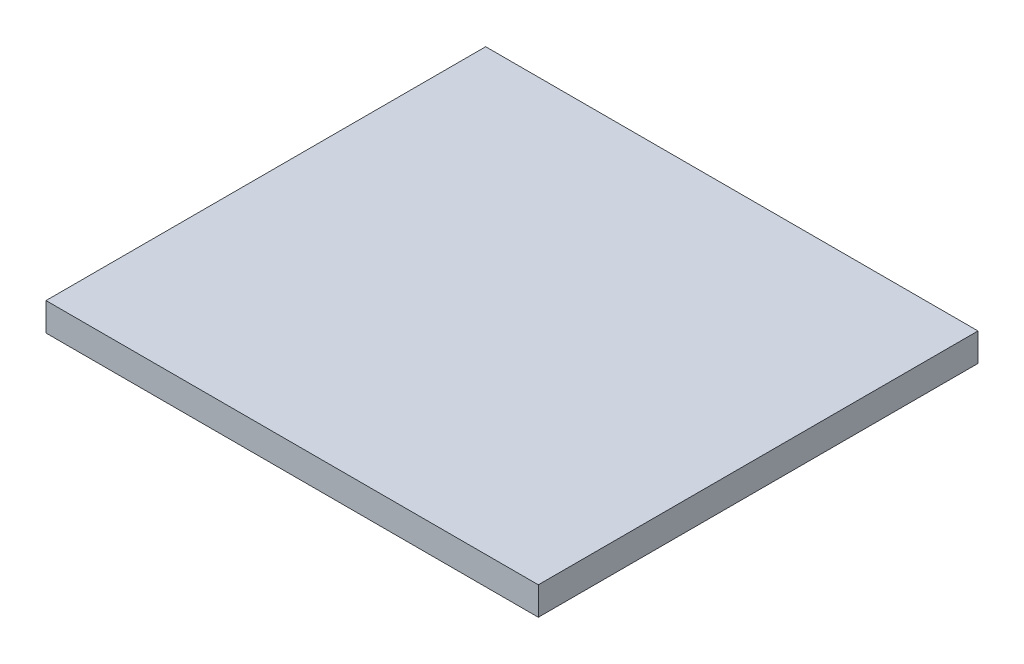
ISO-10303-21;
HEADER;
FILE_DESCRIPTION(('STEP AP214'),'2;1');
FILE_NAME('part.step','',(''),(''),'','','');
FILE_SCHEMA(('AUTOMOTIVE_DESIGN { 1 0 10303 214 1 1 1 1 }'));
ENDSEC;
DATA;
#1=APPLICATION_CONTEXT('core data for automotive mechanical design processes');
#2=APPLICATION_PROTOCOL_DEFINITION('international standard','automotive_design',2000,#1);
#3=PRODUCT_CONTEXT('',#1,'mechanical');
#4=PRODUCT('Part','Part','',(#3));
#5=PRODUCT_RELATED_PRODUCT_CATEGORY('part','',(#4));
#6=PRODUCT_DEFINITION_FORMATION('','',#4);
#7=PRODUCT_DEFINITION_CONTEXT('part definition',#1,'design');
#8=PRODUCT_DEFINITION('design','',#6,#7);
#9=PRODUCT_DEFINITION_SHAPE('','',#8);
#10=(LENGTH_UNIT() NAMED_UNIT(*) SI_UNIT(.MILLI.,.METRE.));
#11=(NAMED_UNIT(*) PLANE_ANGLE_UNIT() SI_UNIT($,.RADIAN.));
#12=(NAMED_UNIT(*) SI_UNIT($,.STERADIAN.) SOLID_ANGLE_UNIT());
#13=UNCERTAINTY_MEASURE_WITH_UNIT(LENGTH_MEASURE(1.E-05),#10,'distance_accuracy_value','');
#14=(GEOMETRIC_REPRESENTATION_CONTEXT(3) GLOBAL_UNCERTAINTY_ASSIGNED_CONTEXT((#13)) GLOBAL_UNIT_ASSIGNED_CONTEXT((#10,
#11,#12)) REPRESENTATION_CONTEXT('',''));
#15=CARTESIAN_POINT('',(0.,0.,0.));
#16=DIRECTION('',(0.,0.,1.));
#17=DIRECTION('',(1.,0.,0.));
#18=AXIS2_PLACEMENT_3D('',#15,#16,#17);
#19=CARTESIAN_POINT('',(333.1,38.1,-297.485));
#20=DIRECTION('',(-1.,0.,0.));
#21=DIRECTION('',(0.,0.,1.));
#22=AXIS2_PLACEMENT_3D('',#19,#20,#21);
#23=PLANE('',#22);
#24=DIRECTION('',(0.,0.,-1.));
#25=VECTOR('',#24,1.);
#26=CARTESIAN_POINT('',(333.1,0.,-297.485));
#27=LINE('',#26,#25);
#28=CARTESIAN_POINT('',(333.1,0.,297.485));
#29=VERTEX_POINT('',#28);
#30=CARTESIAN_POINT('',(333.1,0.,-297.485));
#31=VERTEX_POINT('',#30);
#32=EDGE_CURVE('E97',#29,#31,#27,.T.);
#33=ORIENTED_EDGE('',*,*,#32,.T.);
#34=DIRECTION('',(0.,-1.,0.));
#35=VECTOR('',#34,1.);
#36=CARTESIAN_POINT('',(333.1,38.1,-297.485));
#37=LINE('',#36,#35);
#38=CARTESIAN_POINT('',(333.1,38.1,-297.485));
#39=VERTEX_POINT('',#38);
#40=EDGE_CURVE('E11',#39,#31,#37,.T.);
#41=ORIENTED_EDGE('',*,*,#40,.F.);
#42=DIRECTION('',(0.,0.,-1.));
#43=VECTOR('',#42,1.);
#44=CARTESIAN_POINT('',(333.1,38.1,-297.485));
#45=LINE('',#44,#43);
#46=CARTESIAN_POINT('',(333.1,38.1,297.485));
#47=VERTEX_POINT('',#46);
#48=EDGE_CURVE('E85',#47,#39,#45,.T.);
#49=ORIENTED_EDGE('',*,*,#48,.F.);
#50=DIRECTION('',(0.,-1.,0.));
#51=VECTOR('',#50,1.);
#52=CARTESIAN_POINT('',(333.1,38.1,297.485));
#53=LINE('',#52,#51);
#54=EDGE_CURVE('E93',#47,#29,#53,.T.);
#55=ORIENTED_EDGE('',*,*,#54,.T.);
#56=EDGE_LOOP('',(#33,#41,#49,#55));
#57=FACE_BOUND('',#56,.T.);
#58=ADVANCED_FACE('F34',(#57),#23,.F.);
#59=CARTESIAN_POINT('',(-333.1,38.1,-297.485));
#60=DIRECTION('',(0.,0.,1.));
#61=DIRECTION('',(1.,0.,0.));
#62=AXIS2_PLACEMENT_3D('',#59,#60,#61);
#63=PLANE('',#62);
#64=DIRECTION('',(-1.,0.,0.));
#65=VECTOR('',#64,1.);
#66=CARTESIAN_POINT('',(-333.1,0.,-297.485));
#67=LINE('',#66,#65);
#68=CARTESIAN_POINT('',(-333.1,0.,-297.485));
#69=VERTEX_POINT('',#68);
#70=EDGE_CURVE('E89',#31,#69,#67,.T.);
#71=ORIENTED_EDGE('',*,*,#70,.T.);
#72=DIRECTION('',(0.,-1.,0.));
#73=VECTOR('',#72,1.);
#74=CARTESIAN_POINT('',(-333.1,38.1,-297.485));
#75=LINE('',#74,#73);
#76=CARTESIAN_POINT('',(-333.1,38.1,-297.485));
#77=VERTEX_POINT('',#76);
#78=EDGE_CURVE('E42',#77,#69,#75,.T.);
#79=ORIENTED_EDGE('',*,*,#78,.F.);
#80=DIRECTION('',(-1.,0.,0.));
#81=VECTOR('',#80,1.);
#82=CARTESIAN_POINT('',(-333.1,38.1,-297.485));
#83=LINE('',#82,#81);
#84=EDGE_CURVE('E80',#39,#77,#83,.T.);
#85=ORIENTED_EDGE('',*,*,#84,.F.);
#86=ORIENTED_EDGE('',*,*,#40,.T.);
#87=EDGE_LOOP('',(#71,#79,#85,#86));
#88=FACE_BOUND('',#87,.T.);
#89=ADVANCED_FACE('F88',(#88),#63,.F.);
#90=CARTESIAN_POINT('',(-333.1,38.1,-297.485));
#91=DIRECTION('',(1.,0.,0.));
#92=DIRECTION('',(0.,0.,-1.));
#93=AXIS2_PLACEMENT_3D('',#90,#91,#92);
#94=PLANE('',#93);
#95=DIRECTION('',(0.,0.,1.));
#96=VECTOR('',#95,1.);
#97=CARTESIAN_POINT('',(-333.1,0.,-297.485));
#98=LINE('',#97,#96);
#99=CARTESIAN_POINT('',(-333.1,0.,297.485));
#100=VERTEX_POINT('',#99);
#101=EDGE_CURVE('E67',#69,#100,#98,.T.);
#102=ORIENTED_EDGE('',*,*,#101,.T.);
#103=DIRECTION('',(0.,-1.,0.));
#104=VECTOR('',#103,1.);
#105=CARTESIAN_POINT('',(-333.1,38.1,297.485));
#106=LINE('',#105,#104);
#107=CARTESIAN_POINT('',(-333.1,38.1,297.485));
#108=VERTEX_POINT('',#107);
#109=EDGE_CURVE('E90',#108,#100,#106,.T.);
#110=ORIENTED_EDGE('',*,*,#109,.F.);
#111=DIRECTION('',(0.,0.,1.));
#112=VECTOR('',#111,1.);
#113=CARTESIAN_POINT('',(-333.1,38.1,-297.485));
#114=LINE('',#113,#112);
#115=EDGE_CURVE('E83',#77,#108,#114,.T.);
#116=ORIENTED_EDGE('',*,*,#115,.F.);
#117=ORIENTED_EDGE('',*,*,#78,.T.);
#118=EDGE_LOOP('',(#102,#110,#116,#117));
#119=FACE_BOUND('',#118,.T.);
#120=ADVANCED_FACE('F91',(#119),#94,.F.);
#121=CARTESIAN_POINT('',(-333.1,38.1,297.485));
#122=DIRECTION('',(0.,0.,-1.));
#123=DIRECTION('',(-1.,0.,0.));
#124=AXIS2_PLACEMENT_3D('',#121,#122,#123);
#125=PLANE('',#124);
#126=DIRECTION('',(1.,0.,0.));
#127=VECTOR('',#126,1.);
#128=CARTESIAN_POINT('',(-333.1,0.,297.485));
#129=LINE('',#128,#127);
#130=EDGE_CURVE('E73',#100,#29,#129,.T.);
#131=ORIENTED_EDGE('',*,*,#130,.T.);
#132=ORIENTED_EDGE('',*,*,#54,.F.);
#133=DIRECTION('',(1.,0.,0.));
#134=VECTOR('',#133,1.);
#135=CARTESIAN_POINT('',(-333.1,38.1,297.485));
#136=LINE('',#135,#134);
#137=EDGE_CURVE('E50',#108,#47,#136,.T.);
#138=ORIENTED_EDGE('',*,*,#137,.F.);
#139=ORIENTED_EDGE('',*,*,#109,.T.);
#140=EDGE_LOOP('',(#131,#132,#138,#139));
#141=FACE_BOUND('',#140,.T.);
#142=ADVANCED_FACE('F104',(#141),#125,.F.);
#143=CARTESIAN_POINT('',(0.,38.1,0.));
#144=DIRECTION('',(0.,1.,0.));
#145=DIRECTION('',(0.,0.,1.));
#146=AXIS2_PLACEMENT_3D('',#143,#144,#145);
#147=PLANE('',#146);
#148=ORIENTED_EDGE('',*,*,#48,.T.);
#149=ORIENTED_EDGE('',*,*,#84,.T.);
#150=ORIENTED_EDGE('',*,*,#115,.T.);
#151=ORIENTED_EDGE('',*,*,#137,.T.);
#152=EDGE_LOOP('',(#148,#149,#150,#151));
#153=FACE_BOUND('',#152,.T.);
#154=ADVANCED_FACE('F81',(#153),#147,.T.);
#155=CARTESIAN_POINT('',(0.,0.,0.));
#156=DIRECTION('',(0.,1.,0.));
#157=DIRECTION('',(0.,0.,1.));
#158=AXIS2_PLACEMENT_3D('',#155,#156,#157);
#159=PLANE('',#158);
#160=ORIENTED_EDGE('',*,*,#32,.F.);
#161=ORIENTED_EDGE('',*,*,#130,.F.);
#162=ORIENTED_EDGE('',*,*,#101,.F.);
#163=ORIENTED_EDGE('',*,*,#70,.F.);
#164=EDGE_LOOP('',(#160,#161,#162,#163));
#165=FACE_BOUND('',#164,.T.);
#166=ADVANCED_FACE('F107',(#165),#159,.F.);
#167=CLOSED_SHELL('',(#58,#89,#120,#142,#154,#166));
#168=MANIFOLD_SOLID_BREP('B2',#167);
#169=ADVANCED_BREP_SHAPE_REPRESENTATION('',(#18,#168),#14);
#170=SHAPE_DEFINITION_REPRESENTATION(#9,#169);
ENDSEC;
END-ISO-10303-21;
